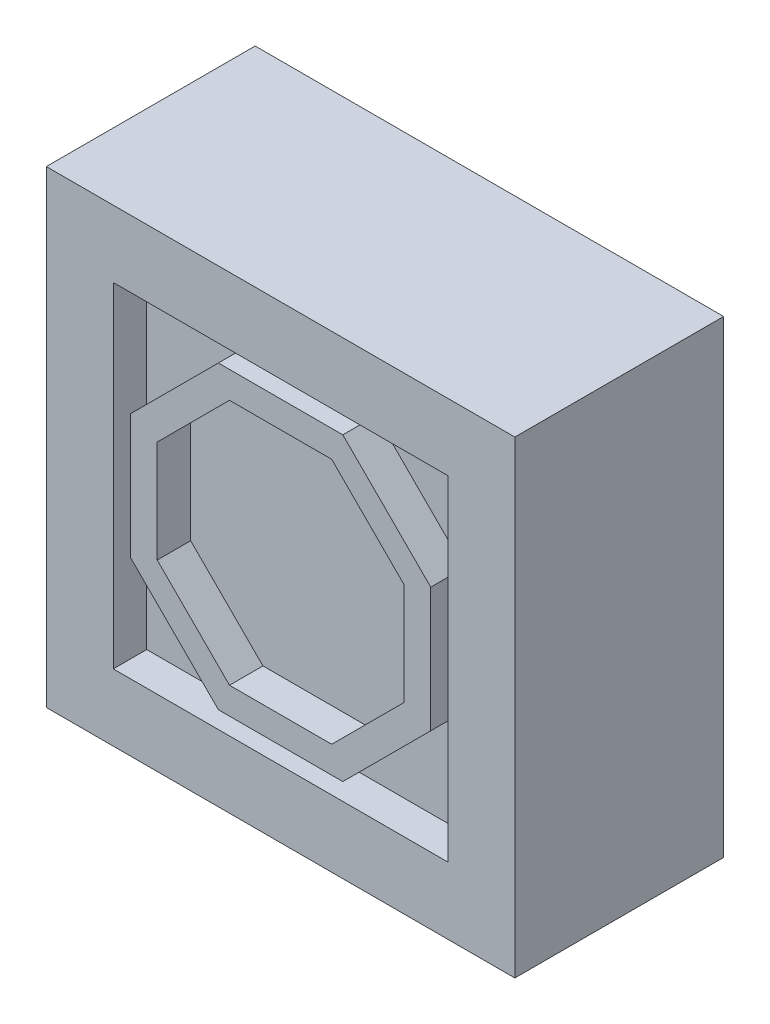
ISO-10303-21;
HEADER;
FILE_DESCRIPTION(('STEP AP214'),'2;1');
FILE_NAME('part.step','',(''),(''),'','','');
FILE_SCHEMA(('AUTOMOTIVE_DESIGN { 1 0 10303 214 1 1 1 1 }'));
ENDSEC;
DATA;
#1=APPLICATION_CONTEXT('core data for automotive mechanical design processes');
#2=APPLICATION_PROTOCOL_DEFINITION('international standard','automotive_design',2000,#1);
#3=PRODUCT_CONTEXT('',#1,'mechanical');
#4=PRODUCT('Part','Part','',(#3));
#5=PRODUCT_RELATED_PRODUCT_CATEGORY('part','',(#4));
#6=PRODUCT_DEFINITION_FORMATION('','',#4);
#7=PRODUCT_DEFINITION_CONTEXT('part definition',#1,'design');
#8=PRODUCT_DEFINITION('design','',#6,#7);
#9=PRODUCT_DEFINITION_SHAPE('','',#8);
#10=(LENGTH_UNIT() NAMED_UNIT(*) SI_UNIT(.MILLI.,.METRE.));
#11=(NAMED_UNIT(*) PLANE_ANGLE_UNIT() SI_UNIT($,.RADIAN.));
#12=(NAMED_UNIT(*) SI_UNIT($,.STERADIAN.) SOLID_ANGLE_UNIT());
#13=UNCERTAINTY_MEASURE_WITH_UNIT(LENGTH_MEASURE(1.E-05),#10,'distance_accuracy_value','');
#14=(GEOMETRIC_REPRESENTATION_CONTEXT(3) GLOBAL_UNCERTAINTY_ASSIGNED_CONTEXT((#13)) GLOBAL_UNIT_ASSIGNED_CONTEXT((#10,
#11,#12)) REPRESENTATION_CONTEXT('',''));
#15=CARTESIAN_POINT('',(0.,0.,0.));
#16=DIRECTION('',(0.,0.,1.));
#17=DIRECTION('',(1.,0.,0.));
#18=AXIS2_PLACEMENT_3D('',#15,#16,#17);
#19=CARTESIAN_POINT('',(-1.75,1.75,1.56));
#20=DIRECTION('',(1.,0.,0.));
#21=DIRECTION('',(0.,1.,0.));
#22=AXIS2_PLACEMENT_3D('',#19,#20,#21);
#23=PLANE('',#22);
#24=DIRECTION('',(0.,-1.,0.));
#25=VECTOR('',#24,1.);
#26=CARTESIAN_POINT('',(-1.75,1.75,0.));
#27=LINE('',#26,#25);
#28=CARTESIAN_POINT('',(-1.75,1.75,0.));
#29=VERTEX_POINT('',#28);
#30=CARTESIAN_POINT('',(-1.75,-1.75,0.));
#31=VERTEX_POINT('',#30);
#32=EDGE_CURVE('E321',#29,#31,#27,.T.);
#33=ORIENTED_EDGE('',*,*,#32,.T.);
#34=DIRECTION('',(0.,0.,-1.));
#35=VECTOR('',#34,1.);
#36=CARTESIAN_POINT('',(-1.75,-1.75,1.56));
#37=LINE('',#36,#35);
#38=CARTESIAN_POINT('',(-1.75,-1.75,1.56));
#39=VERTEX_POINT('',#38);
#40=EDGE_CURVE('E11',#39,#31,#37,.T.);
#41=ORIENTED_EDGE('',*,*,#40,.F.);
#42=DIRECTION('',(0.,-1.,0.));
#43=VECTOR('',#42,1.);
#44=CARTESIAN_POINT('',(-1.75,1.75,1.56));
#45=LINE('',#44,#43);
#46=CARTESIAN_POINT('',(-1.75,1.75,1.56));
#47=VERTEX_POINT('',#46);
#48=EDGE_CURVE('E328',#47,#39,#45,.T.);
#49=ORIENTED_EDGE('',*,*,#48,.F.);
#50=DIRECTION('',(0.,0.,-1.));
#51=VECTOR('',#50,1.);
#52=CARTESIAN_POINT('',(-1.75,1.75,1.56));
#53=LINE('',#52,#51);
#54=EDGE_CURVE('E338',#47,#29,#53,.T.);
#55=ORIENTED_EDGE('',*,*,#54,.T.);
#56=EDGE_LOOP('',(#33,#41,#49,#55));
#57=FACE_BOUND('',#56,.T.);
#58=ADVANCED_FACE('F39',(#57),#23,.F.);
#59=CARTESIAN_POINT('',(1.75,-1.75,1.56));
#60=DIRECTION('',(0.,1.,0.));
#61=DIRECTION('',(-1.,0.,0.));
#62=AXIS2_PLACEMENT_3D('',#59,#60,#61);
#63=PLANE('',#62);
#64=DIRECTION('',(1.,0.,0.));
#65=VECTOR('',#64,1.);
#66=CARTESIAN_POINT('',(1.75,-1.75,0.));
#67=LINE('',#66,#65);
#68=CARTESIAN_POINT('',(1.75,-1.75,0.));
#69=VERTEX_POINT('',#68);
#70=EDGE_CURVE('E341',#31,#69,#67,.T.);
#71=ORIENTED_EDGE('',*,*,#70,.T.);
#72=DIRECTION('',(0.,0.,-1.));
#73=VECTOR('',#72,1.);
#74=CARTESIAN_POINT('',(1.75,-1.75,1.56));
#75=LINE('',#74,#73);
#76=CARTESIAN_POINT('',(1.75,-1.75,1.56));
#77=VERTEX_POINT('',#76);
#78=EDGE_CURVE('E46',#77,#69,#75,.T.);
#79=ORIENTED_EDGE('',*,*,#78,.F.);
#80=DIRECTION('',(1.,0.,0.));
#81=VECTOR('',#80,1.);
#82=CARTESIAN_POINT('',(1.75,-1.75,1.56));
#83=LINE('',#82,#81);
#84=EDGE_CURVE('E331',#39,#77,#83,.T.);
#85=ORIENTED_EDGE('',*,*,#84,.F.);
#86=ORIENTED_EDGE('',*,*,#40,.T.);
#87=EDGE_LOOP('',(#71,#79,#85,#86));
#88=FACE_BOUND('',#87,.T.);
#89=ADVANCED_FACE('F371',(#88),#63,.F.);
#90=CARTESIAN_POINT('',(1.75,1.75,1.56));
#91=DIRECTION('',(-1.,0.,0.));
#92=DIRECTION('',(0.,-1.,0.));
#93=AXIS2_PLACEMENT_3D('',#90,#91,#92);
#94=PLANE('',#93);
#95=DIRECTION('',(0.,1.,0.));
#96=VECTOR('',#95,1.);
#97=CARTESIAN_POINT('',(1.75,1.75,0.));
#98=LINE('',#97,#96);
#99=CARTESIAN_POINT('',(1.75,1.75,0.));
#100=VERTEX_POINT('',#99);
#101=EDGE_CURVE('E343',#69,#100,#98,.T.);
#102=ORIENTED_EDGE('',*,*,#101,.T.);
#103=DIRECTION('',(0.,0.,-1.));
#104=VECTOR('',#103,1.);
#105=CARTESIAN_POINT('',(1.75,1.75,1.56));
#106=LINE('',#105,#104);
#107=CARTESIAN_POINT('',(1.75,1.75,1.56));
#108=VERTEX_POINT('',#107);
#109=EDGE_CURVE('E348',#108,#100,#106,.T.);
#110=ORIENTED_EDGE('',*,*,#109,.F.);
#111=DIRECTION('',(0.,1.,0.));
#112=VECTOR('',#111,1.);
#113=CARTESIAN_POINT('',(1.75,1.75,1.56));
#114=LINE('',#113,#112);
#115=EDGE_CURVE('E334',#77,#108,#114,.T.);
#116=ORIENTED_EDGE('',*,*,#115,.F.);
#117=ORIENTED_EDGE('',*,*,#78,.T.);
#118=EDGE_LOOP('',(#102,#110,#116,#117));
#119=FACE_BOUND('',#118,.T.);
#120=ADVANCED_FACE('F355',(#119),#94,.F.);
#121=CARTESIAN_POINT('',(1.75,1.75,1.56));
#122=DIRECTION('',(0.,-1.,0.));
#123=DIRECTION('',(1.,0.,0.));
#124=AXIS2_PLACEMENT_3D('',#121,#122,#123);
#125=PLANE('',#124);
#126=DIRECTION('',(-1.,0.,0.));
#127=VECTOR('',#126,1.);
#128=CARTESIAN_POINT('',(1.75,1.75,0.));
#129=LINE('',#128,#127);
#130=EDGE_CURVE('E332',#100,#29,#129,.T.);
#131=ORIENTED_EDGE('',*,*,#130,.T.);
#132=ORIENTED_EDGE('',*,*,#54,.F.);
#133=DIRECTION('',(-1.,0.,0.));
#134=VECTOR('',#133,1.);
#135=CARTESIAN_POINT('',(1.75,1.75,1.56));
#136=LINE('',#135,#134);
#137=EDGE_CURVE('E336',#108,#47,#136,.T.);
#138=ORIENTED_EDGE('',*,*,#137,.F.);
#139=ORIENTED_EDGE('',*,*,#109,.T.);
#140=EDGE_LOOP('',(#131,#132,#138,#139));
#141=FACE_BOUND('',#140,.T.);
#142=ADVANCED_FACE('F364',(#141),#125,.F.);
#143=CARTESIAN_POINT('',(0.,0.,1.56));
#144=DIRECTION('',(0.,0.,-1.));
#145=DIRECTION('',(-1.,0.,0.));
#146=AXIS2_PLACEMENT_3D('',#143,#144,#145);
#147=PLANE('',#146);
#148=DIRECTION('',(0.,-1.,0.));
#149=VECTOR('',#148,1.);
#150=CARTESIAN_POINT('',(-1.25,1.25,1.56));
#151=LINE('',#150,#149);
#152=CARTESIAN_POINT('',(-1.25,1.25,1.56));
#153=VERTEX_POINT('',#152);
#154=CARTESIAN_POINT('',(-1.25,-1.25,1.56));
#155=VERTEX_POINT('',#154);
#156=EDGE_CURVE('E310',#153,#155,#151,.T.);
#157=ORIENTED_EDGE('',*,*,#156,.F.);
#158=DIRECTION('',(-1.,0.,0.));
#159=VECTOR('',#158,1.);
#160=CARTESIAN_POINT('',(1.25,1.25,1.56));
#161=LINE('',#160,#159);
#162=CARTESIAN_POINT('',(1.25,1.25,1.56));
#163=VERTEX_POINT('',#162);
#164=EDGE_CURVE('E308',#163,#153,#161,.T.);
#165=ORIENTED_EDGE('',*,*,#164,.F.);
#166=DIRECTION('',(0.,1.,0.));
#167=VECTOR('',#166,1.);
#168=CARTESIAN_POINT('',(1.25,-1.25,1.56));
#169=LINE('',#168,#167);
#170=CARTESIAN_POINT('',(1.25,-1.25,1.56));
#171=VERTEX_POINT('',#170);
#172=EDGE_CURVE('E298',#171,#163,#169,.T.);
#173=ORIENTED_EDGE('',*,*,#172,.F.);
#174=DIRECTION('',(1.,0.,0.));
#175=VECTOR('',#174,1.);
#176=CARTESIAN_POINT('',(-1.25,-1.25,1.56));
#177=LINE('',#176,#175);
#178=EDGE_CURVE('E314',#155,#171,#177,.T.);
#179=ORIENTED_EDGE('',*,*,#178,.F.);
#180=EDGE_LOOP('',(#157,#165,#173,#179));
#181=FACE_BOUND('',#180,.T.);
#182=ORIENTED_EDGE('',*,*,#48,.T.);
#183=ORIENTED_EDGE('',*,*,#84,.T.);
#184=ORIENTED_EDGE('',*,*,#115,.T.);
#185=ORIENTED_EDGE('',*,*,#137,.T.);
#186=EDGE_LOOP('',(#182,#183,#184,#185));
#187=FACE_BOUND('',#186,.T.);
#188=ADVANCED_FACE('F370',(#181,#187),#147,.F.);
#189=CARTESIAN_POINT('',(0.,0.,0.));
#190=DIRECTION('',(0.,0.,-1.));
#191=DIRECTION('',(-1.,0.,0.));
#192=AXIS2_PLACEMENT_3D('',#189,#190,#191);
#193=PLANE('',#192);
#194=ORIENTED_EDGE('',*,*,#32,.F.);
#195=ORIENTED_EDGE('',*,*,#130,.F.);
#196=ORIENTED_EDGE('',*,*,#101,.F.);
#197=ORIENTED_EDGE('',*,*,#70,.F.);
#198=EDGE_LOOP('',(#194,#195,#196,#197));
#199=FACE_BOUND('',#198,.T.);
#200=ADVANCED_FACE('F361',(#199),#193,.T.);
#201=CARTESIAN_POINT('',(1.25,1.25,1.31));
#202=DIRECTION('',(0.,1.,0.));
#203=DIRECTION('',(-1.,0.,0.));
#204=AXIS2_PLACEMENT_3D('',#201,#202,#203);
#205=PLANE('',#204);
#206=ORIENTED_EDGE('',*,*,#164,.T.);
#207=DIRECTION('',(0.,0.,1.));
#208=VECTOR('',#207,1.);
#209=CARTESIAN_POINT('',(-1.25,1.25,1.31));
#210=LINE('',#209,#208);
#211=CARTESIAN_POINT('',(-1.25,1.25,1.31));
#212=VERTEX_POINT('',#211);
#213=EDGE_CURVE('E307',#212,#153,#210,.T.);
#214=ORIENTED_EDGE('',*,*,#213,.F.);
#215=DIRECTION('',(-1.,0.,0.));
#216=VECTOR('',#215,1.);
#217=CARTESIAN_POINT('',(1.25,1.25,1.31));
#218=LINE('',#217,#216);
#219=CARTESIAN_POINT('',(1.25,1.25,1.31));
#220=VERTEX_POINT('',#219);
#221=EDGE_CURVE('E294',#220,#212,#218,.T.);
#222=ORIENTED_EDGE('',*,*,#221,.F.);
#223=DIRECTION('',(0.,0.,1.));
#224=VECTOR('',#223,1.);
#225=CARTESIAN_POINT('',(1.25,1.25,1.31));
#226=LINE('',#225,#224);
#227=EDGE_CURVE('E319',#220,#163,#226,.T.);
#228=ORIENTED_EDGE('',*,*,#227,.T.);
#229=EDGE_LOOP('',(#206,#214,#222,#228));
#230=FACE_BOUND('',#229,.T.);
#231=ADVANCED_FACE('F383',(#230),#205,.F.);
#232=CARTESIAN_POINT('',(1.25,-1.25,1.31));
#233=DIRECTION('',(1.,0.,0.));
#234=DIRECTION('',(0.,1.,0.));
#235=AXIS2_PLACEMENT_3D('',#232,#233,#234);
#236=PLANE('',#235);
#237=ORIENTED_EDGE('',*,*,#172,.T.);
#238=ORIENTED_EDGE('',*,*,#227,.F.);
#239=DIRECTION('',(0.,1.,0.));
#240=VECTOR('',#239,1.);
#241=CARTESIAN_POINT('',(1.25,-1.25,1.31));
#242=LINE('',#241,#240);
#243=CARTESIAN_POINT('',(1.25,-1.25,1.31));
#244=VERTEX_POINT('',#243);
#245=EDGE_CURVE('E304',#244,#220,#242,.T.);
#246=ORIENTED_EDGE('',*,*,#245,.F.);
#247=DIRECTION('',(0.,0.,1.));
#248=VECTOR('',#247,1.);
#249=CARTESIAN_POINT('',(1.25,-1.25,1.31));
#250=LINE('',#249,#248);
#251=EDGE_CURVE('E322',#244,#171,#250,.T.);
#252=ORIENTED_EDGE('',*,*,#251,.T.);
#253=EDGE_LOOP('',(#237,#238,#246,#252));
#254=FACE_BOUND('',#253,.T.);
#255=ADVANCED_FACE('F389',(#254),#236,.F.);
#256=CARTESIAN_POINT('',(-1.25,-1.25,1.31));
#257=DIRECTION('',(0.,-1.,0.));
#258=DIRECTION('',(1.,0.,0.));
#259=AXIS2_PLACEMENT_3D('',#256,#257,#258);
#260=PLANE('',#259);
#261=ORIENTED_EDGE('',*,*,#178,.T.);
#262=ORIENTED_EDGE('',*,*,#251,.F.);
#263=DIRECTION('',(1.,0.,0.));
#264=VECTOR('',#263,1.);
#265=CARTESIAN_POINT('',(-1.25,-1.25,1.31));
#266=LINE('',#265,#264);
#267=CARTESIAN_POINT('',(-1.25,-1.25,1.31));
#268=VERTEX_POINT('',#267);
#269=EDGE_CURVE('E301',#268,#244,#266,.T.);
#270=ORIENTED_EDGE('',*,*,#269,.F.);
#271=DIRECTION('',(0.,0.,1.));
#272=VECTOR('',#271,1.);
#273=CARTESIAN_POINT('',(-1.25,-1.25,1.31));
#274=LINE('',#273,#272);
#275=EDGE_CURVE('E324',#268,#155,#274,.T.);
#276=ORIENTED_EDGE('',*,*,#275,.T.);
#277=EDGE_LOOP('',(#261,#262,#270,#276));
#278=FACE_BOUND('',#277,.T.);
#279=ADVANCED_FACE('F395',(#278),#260,.F.);
#280=CARTESIAN_POINT('',(-1.25,1.25,1.31));
#281=DIRECTION('',(-1.,0.,0.));
#282=DIRECTION('',(0.,-1.,0.));
#283=AXIS2_PLACEMENT_3D('',#280,#281,#282);
#284=PLANE('',#283);
#285=ORIENTED_EDGE('',*,*,#156,.T.);
#286=ORIENTED_EDGE('',*,*,#275,.F.);
#287=DIRECTION('',(0.,-1.,0.));
#288=VECTOR('',#287,1.);
#289=CARTESIAN_POINT('',(-1.25,1.25,1.31));
#290=LINE('',#289,#288);
#291=EDGE_CURVE('E297',#212,#268,#290,.T.);
#292=ORIENTED_EDGE('',*,*,#291,.F.);
#293=ORIENTED_EDGE('',*,*,#213,.T.);
#294=EDGE_LOOP('',(#285,#286,#292,#293));
#295=FACE_BOUND('',#294,.T.);
#296=ADVANCED_FACE('F391',(#295),#284,.F.);
#297=CARTESIAN_POINT('',(0.,0.,1.31));
#298=DIRECTION('',(0.,0.,1.));
#299=DIRECTION('',(1.,0.,0.));
#300=AXIS2_PLACEMENT_3D('',#297,#298,#299);
#301=PLANE('',#300);
#302=DIRECTION('',(0.707106781186548,0.707106781186548,0.));
#303=VECTOR('',#302,1.);
#304=CARTESIAN_POINT('',(-0.464655200100848,1.12177688591065,1.31));
#305=LINE('',#304,#303);
#306=CARTESIAN_POINT('',(-1.12177688591065,0.464655200100848,1.31));
#307=VERTEX_POINT('',#306);
#308=CARTESIAN_POINT('',(-0.464655200100848,1.12177688591065,1.31));
#309=VERTEX_POINT('',#308);
#310=EDGE_CURVE('E311',#307,#309,#305,.T.);
#311=ORIENTED_EDGE('',*,*,#310,.T.);
#312=DIRECTION('',(1.,0.,0.));
#313=VECTOR('',#312,1.);
#314=CARTESIAN_POINT('',(0.464655200100848,1.12177688591065,1.31));
#315=LINE('',#314,#313);
#316=CARTESIAN_POINT('',(0.464655200100848,1.12177688591065,1.31));
#317=VERTEX_POINT('',#316);
#318=EDGE_CURVE('E478',#309,#317,#315,.T.);
#319=ORIENTED_EDGE('',*,*,#318,.T.);
#320=DIRECTION('',(0.707106781186548,-0.707106781186548,0.));
#321=VECTOR('',#320,1.);
#322=CARTESIAN_POINT('',(1.12177688591065,0.464655200100849,1.31));
#323=LINE('',#322,#321);
#324=CARTESIAN_POINT('',(1.12177688591065,0.464655200100849,1.31));
#325=VERTEX_POINT('',#324);
#326=EDGE_CURVE('E497',#317,#325,#323,.T.);
#327=ORIENTED_EDGE('',*,*,#326,.T.);
#328=DIRECTION('',(0.,-1.,0.));
#329=VECTOR('',#328,1.);
#330=CARTESIAN_POINT('',(1.12177688591065,-0.464655200100849,1.31));
#331=LINE('',#330,#329);
#332=CARTESIAN_POINT('',(1.12177688591065,-0.464655200100849,1.31));
#333=VERTEX_POINT('',#332);
#334=EDGE_CURVE('E495',#325,#333,#331,.T.);
#335=ORIENTED_EDGE('',*,*,#334,.T.);
#336=DIRECTION('',(-0.707106781186547,-0.707106781186548,0.));
#337=VECTOR('',#336,1.);
#338=CARTESIAN_POINT('',(0.464655200100849,-1.12177688591065,1.31));
#339=LINE('',#338,#337);
#340=CARTESIAN_POINT('',(0.464655200100849,-1.12177688591065,1.31));
#341=VERTEX_POINT('',#340);
#342=EDGE_CURVE('E493',#333,#341,#339,.T.);
#343=ORIENTED_EDGE('',*,*,#342,.T.);
#344=DIRECTION('',(-1.,0.,0.));
#345=VECTOR('',#344,1.);
#346=CARTESIAN_POINT('',(-0.464655200100848,-1.12177688591065,1.31));
#347=LINE('',#346,#345);
#348=CARTESIAN_POINT('',(-0.464655200100848,-1.12177688591065,1.31));
#349=VERTEX_POINT('',#348);
#350=EDGE_CURVE('E491',#341,#349,#347,.T.);
#351=ORIENTED_EDGE('',*,*,#350,.T.);
#352=DIRECTION('',(-0.707106781186548,0.707106781186548,0.));
#353=VECTOR('',#352,1.);
#354=CARTESIAN_POINT('',(-1.12177688591065,-0.464655200100849,1.31));
#355=LINE('',#354,#353);
#356=CARTESIAN_POINT('',(-1.12177688591065,-0.464655200100849,1.31));
#357=VERTEX_POINT('',#356);
#358=EDGE_CURVE('E58',#349,#357,#355,.T.);
#359=ORIENTED_EDGE('',*,*,#358,.T.);
#360=DIRECTION('',(0.,1.,0.));
#361=VECTOR('',#360,1.);
#362=CARTESIAN_POINT('',(-1.12177688591065,0.464655200100848,1.31));
#363=LINE('',#362,#361);
#364=EDGE_CURVE('E53',#357,#307,#363,.T.);
#365=ORIENTED_EDGE('',*,*,#364,.T.);
#366=EDGE_LOOP('',(#311,#319,#327,#335,#343,#351,#359,#365));
#367=FACE_BOUND('',#366,.T.);
#368=ORIENTED_EDGE('',*,*,#221,.T.);
#369=ORIENTED_EDGE('',*,*,#291,.T.);
#370=ORIENTED_EDGE('',*,*,#269,.T.);
#371=ORIENTED_EDGE('',*,*,#245,.T.);
#372=EDGE_LOOP('',(#368,#369,#370,#371));
#373=FACE_BOUND('',#372,.T.);
#374=ADVANCED_FACE('F394',(#367,#373),#301,.T.);
#375=CARTESIAN_POINT('',(-0.464655200100848,1.12177688591065,-1.862864172023));
#376=DIRECTION('',(-0.707106781186548,0.707106781186548,0.));
#377=DIRECTION('',(-0.707106781186548,-0.707106781186548,0.));
#378=AXIS2_PLACEMENT_3D('',#375,#376,#377);
#379=PLANE('',#378);
#380=ORIENTED_EDGE('',*,*,#310,.F.);
#381=DIRECTION('',(0.,0.,1.));
#382=VECTOR('',#381,1.);
#383=CARTESIAN_POINT('',(-1.12177688591065,0.464655200100848,-1.862864172023));
#384=LINE('',#383,#382);
#385=CARTESIAN_POINT('',(-1.12177688591065,0.464655200100848,1.56));
#386=VERTEX_POINT('',#385);
#387=EDGE_CURVE('E290',#307,#386,#384,.T.);
#388=ORIENTED_EDGE('',*,*,#387,.T.);
#389=DIRECTION('',(-0.707106781186547,-0.707106781186548,0.));
#390=VECTOR('',#389,1.);
#391=CARTESIAN_POINT('',(-0.464655200100848,1.12177688591065,1.56));
#392=LINE('',#391,#390);
#393=CARTESIAN_POINT('',(-0.464655200100848,1.12177688591065,1.56));
#394=VERTEX_POINT('',#393);
#395=EDGE_CURVE('E255',#394,#386,#392,.T.);
#396=ORIENTED_EDGE('',*,*,#395,.F.);
#397=DIRECTION('',(0.,0.,1.));
#398=VECTOR('',#397,1.);
#399=CARTESIAN_POINT('',(-0.464655200100848,1.12177688591065,-1.862864172023));
#400=LINE('',#399,#398);
#401=EDGE_CURVE('E276',#309,#394,#400,.T.);
#402=ORIENTED_EDGE('',*,*,#401,.F.);
#403=EDGE_LOOP('',(#380,#388,#396,#402));
#404=FACE_BOUND('',#403,.T.);
#405=ADVANCED_FACE('F405',(#404),#379,.T.);
#406=CARTESIAN_POINT('',(-1.12177688591065,0.464655200100848,-1.862864172023));
#407=DIRECTION('',(-1.,0.,0.));
#408=DIRECTION('',(0.,-1.,0.));
#409=AXIS2_PLACEMENT_3D('',#406,#407,#408);
#410=PLANE('',#409);
#411=ORIENTED_EDGE('',*,*,#364,.F.);
#412=DIRECTION('',(0.,0.,1.));
#413=VECTOR('',#412,1.);
#414=CARTESIAN_POINT('',(-1.12177688591065,-0.464655200100849,-1.862864172023));
#415=LINE('',#414,#413);
#416=CARTESIAN_POINT('',(-1.12177688591065,-0.464655200100849,1.56));
#417=VERTEX_POINT('',#416);
#418=EDGE_CURVE('E288',#357,#417,#415,.T.);
#419=ORIENTED_EDGE('',*,*,#418,.T.);
#420=DIRECTION('',(0.,-1.,0.));
#421=VECTOR('',#420,1.);
#422=CARTESIAN_POINT('',(-1.12177688591065,0.464655200100848,1.56));
#423=LINE('',#422,#421);
#424=EDGE_CURVE('E258',#386,#417,#423,.T.);
#425=ORIENTED_EDGE('',*,*,#424,.F.);
#426=ORIENTED_EDGE('',*,*,#387,.F.);
#427=EDGE_LOOP('',(#411,#419,#425,#426));
#428=FACE_BOUND('',#427,.T.);
#429=ADVANCED_FACE('F414',(#428),#410,.T.);
#430=CARTESIAN_POINT('',(-1.12177688591065,-0.464655200100849,-1.862864172023));
#431=DIRECTION('',(-0.707106781186548,-0.707106781186548,0.));
#432=DIRECTION('',(0.707106781186548,-0.707106781186548,0.));
#433=AXIS2_PLACEMENT_3D('',#430,#431,#432);
#434=PLANE('',#433);
#435=ORIENTED_EDGE('',*,*,#358,.F.);
#436=DIRECTION('',(0.,0.,1.));
#437=VECTOR('',#436,1.);
#438=CARTESIAN_POINT('',(-0.464655200100848,-1.12177688591065,-1.862864172023));
#439=LINE('',#438,#437);
#440=CARTESIAN_POINT('',(-0.464655200100848,-1.12177688591065,1.56));
#441=VERTEX_POINT('',#440);
#442=EDGE_CURVE('E286',#349,#441,#439,.T.);
#443=ORIENTED_EDGE('',*,*,#442,.T.);
#444=DIRECTION('',(0.707106781186548,-0.707106781186548,0.));
#445=VECTOR('',#444,1.);
#446=CARTESIAN_POINT('',(-1.12177688591065,-0.464655200100849,1.56));
#447=LINE('',#446,#445);
#448=EDGE_CURVE('E261',#417,#441,#447,.T.);
#449=ORIENTED_EDGE('',*,*,#448,.F.);
#450=ORIENTED_EDGE('',*,*,#418,.F.);
#451=EDGE_LOOP('',(#435,#443,#449,#450));
#452=FACE_BOUND('',#451,.T.);
#453=ADVANCED_FACE('F418',(#452),#434,.T.);
#454=CARTESIAN_POINT('',(-0.464655200100848,-1.12177688591065,-1.862864172023));
#455=DIRECTION('',(0.,-1.,0.));
#456=DIRECTION('',(1.,0.,0.));
#457=AXIS2_PLACEMENT_3D('',#454,#455,#456);
#458=PLANE('',#457);
#459=ORIENTED_EDGE('',*,*,#350,.F.);
#460=DIRECTION('',(0.,0.,1.));
#461=VECTOR('',#460,1.);
#462=CARTESIAN_POINT('',(0.464655200100849,-1.12177688591065,-1.862864172023));
#463=LINE('',#462,#461);
#464=CARTESIAN_POINT('',(0.464655200100849,-1.12177688591065,1.56));
#465=VERTEX_POINT('',#464);
#466=EDGE_CURVE('E284',#341,#465,#463,.T.);
#467=ORIENTED_EDGE('',*,*,#466,.T.);
#468=DIRECTION('',(1.,0.,0.));
#469=VECTOR('',#468,1.);
#470=CARTESIAN_POINT('',(-0.464655200100848,-1.12177688591065,1.56));
#471=LINE('',#470,#469);
#472=EDGE_CURVE('E264',#441,#465,#471,.T.);
#473=ORIENTED_EDGE('',*,*,#472,.F.);
#474=ORIENTED_EDGE('',*,*,#442,.F.);
#475=EDGE_LOOP('',(#459,#467,#473,#474));
#476=FACE_BOUND('',#475,.T.);
#477=ADVANCED_FACE('F422',(#476),#458,.T.);
#478=CARTESIAN_POINT('',(0.464655200100849,-1.12177688591065,-1.862864172023));
#479=DIRECTION('',(0.707106781186548,-0.707106781186547,0.));
#480=DIRECTION('',(0.707106781186547,0.707106781186548,0.));
#481=AXIS2_PLACEMENT_3D('',#478,#479,#480);
#482=PLANE('',#481);
#483=ORIENTED_EDGE('',*,*,#342,.F.);
#484=DIRECTION('',(0.,0.,1.));
#485=VECTOR('',#484,1.);
#486=CARTESIAN_POINT('',(1.12177688591065,-0.464655200100849,-1.862864172023));
#487=LINE('',#486,#485);
#488=CARTESIAN_POINT('',(1.12177688591065,-0.464655200100849,1.56));
#489=VERTEX_POINT('',#488);
#490=EDGE_CURVE('E282',#333,#489,#487,.T.);
#491=ORIENTED_EDGE('',*,*,#490,.T.);
#492=DIRECTION('',(0.707106781186547,0.707106781186548,0.));
#493=VECTOR('',#492,1.);
#494=CARTESIAN_POINT('',(0.464655200100849,-1.12177688591065,1.56));
#495=LINE('',#494,#493);
#496=EDGE_CURVE('E267',#465,#489,#495,.T.);
#497=ORIENTED_EDGE('',*,*,#496,.F.);
#498=ORIENTED_EDGE('',*,*,#466,.F.);
#499=EDGE_LOOP('',(#483,#491,#497,#498));
#500=FACE_BOUND('',#499,.T.);
#501=ADVANCED_FACE('F426',(#500),#482,.T.);
#502=CARTESIAN_POINT('',(1.12177688591065,-0.464655200100849,-1.862864172023));
#503=DIRECTION('',(1.,0.,0.));
#504=DIRECTION('',(0.,0.,-1.));
#505=AXIS2_PLACEMENT_3D('',#502,#503,#504);
#506=PLANE('',#505);
#507=ORIENTED_EDGE('',*,*,#334,.F.);
#508=DIRECTION('',(0.,0.,1.));
#509=VECTOR('',#508,1.);
#510=CARTESIAN_POINT('',(1.12177688591065,0.464655200100849,-1.862864172023));
#511=LINE('',#510,#509);
#512=CARTESIAN_POINT('',(1.12177688591065,0.464655200100849,1.56));
#513=VERTEX_POINT('',#512);
#514=EDGE_CURVE('E280',#325,#513,#511,.T.);
#515=ORIENTED_EDGE('',*,*,#514,.T.);
#516=DIRECTION('',(0.,1.,0.));
#517=VECTOR('',#516,1.);
#518=CARTESIAN_POINT('',(1.12177688591065,-0.464655200100849,1.56));
#519=LINE('',#518,#517);
#520=EDGE_CURVE('E270',#489,#513,#519,.T.);
#521=ORIENTED_EDGE('',*,*,#520,.F.);
#522=ORIENTED_EDGE('',*,*,#490,.F.);
#523=EDGE_LOOP('',(#507,#515,#521,#522));
#524=FACE_BOUND('',#523,.T.);
#525=ADVANCED_FACE('F430',(#524),#506,.T.);
#526=CARTESIAN_POINT('',(1.12177688591065,0.464655200100849,-1.862864172023));
#527=DIRECTION('',(0.707106781186548,0.707106781186548,0.));
#528=DIRECTION('',(-0.707106781186548,0.707106781186548,0.));
#529=AXIS2_PLACEMENT_3D('',#526,#527,#528);
#530=PLANE('',#529);
#531=ORIENTED_EDGE('',*,*,#326,.F.);
#532=DIRECTION('',(0.,0.,1.));
#533=VECTOR('',#532,1.);
#534=CARTESIAN_POINT('',(0.464655200100848,1.12177688591065,-1.862864172023));
#535=LINE('',#534,#533);
#536=CARTESIAN_POINT('',(0.464655200100848,1.12177688591065,1.56));
#537=VERTEX_POINT('',#536);
#538=EDGE_CURVE('E277',#317,#537,#535,.T.);
#539=ORIENTED_EDGE('',*,*,#538,.T.);
#540=DIRECTION('',(-0.707106781186548,0.707106781186547,0.));
#541=VECTOR('',#540,1.);
#542=CARTESIAN_POINT('',(1.12177688591065,0.464655200100849,1.56));
#543=LINE('',#542,#541);
#544=EDGE_CURVE('E273',#513,#537,#543,.T.);
#545=ORIENTED_EDGE('',*,*,#544,.F.);
#546=ORIENTED_EDGE('',*,*,#514,.F.);
#547=EDGE_LOOP('',(#531,#539,#545,#546));
#548=FACE_BOUND('',#547,.T.);
#549=ADVANCED_FACE('F410',(#548),#530,.T.);
#550=CARTESIAN_POINT('',(0.464655200100848,1.12177688591065,-1.862864172023));
#551=DIRECTION('',(0.,1.,0.));
#552=DIRECTION('',(0.,0.,1.));
#553=AXIS2_PLACEMENT_3D('',#550,#551,#552);
#554=PLANE('',#553);
#555=ORIENTED_EDGE('',*,*,#318,.F.);
#556=ORIENTED_EDGE('',*,*,#401,.T.);
#557=DIRECTION('',(-1.,0.,0.));
#558=VECTOR('',#557,1.);
#559=CARTESIAN_POINT('',(0.464655200100848,1.12177688591065,1.56));
#560=LINE('',#559,#558);
#561=EDGE_CURVE('E242',#537,#394,#560,.T.);
#562=ORIENTED_EDGE('',*,*,#561,.F.);
#563=ORIENTED_EDGE('',*,*,#538,.F.);
#564=EDGE_LOOP('',(#555,#556,#562,#563));
#565=FACE_BOUND('',#564,.T.);
#566=ADVANCED_FACE('F407',(#565),#554,.T.);
#567=CARTESIAN_POINT('',(0.,0.,1.56));
#568=DIRECTION('',(0.,0.,1.));
#569=DIRECTION('',(1.,0.,0.));
#570=AXIS2_PLACEMENT_3D('',#567,#568,#569);
#571=PLANE('',#570);
#572=DIRECTION('',(-1.,0.,0.));
#573=VECTOR('',#572,1.);
#574=CARTESIAN_POINT('',(0.38181248762623,0.921776885910652,1.56));
#575=LINE('',#574,#573);
#576=CARTESIAN_POINT('',(0.38181248762623,0.921776885910652,1.56));
#577=VERTEX_POINT('',#576);
#578=CARTESIAN_POINT('',(-0.381812487626229,0.921776885910652,1.56));
#579=VERTEX_POINT('',#578);
#580=EDGE_CURVE('E217',#577,#579,#575,.T.);
#581=ORIENTED_EDGE('',*,*,#580,.F.);
#582=DIRECTION('',(-0.707106781186548,0.707106781186548,0.));
#583=VECTOR('',#582,1.);
#584=CARTESIAN_POINT('',(0.921776885910652,0.38181248762623,1.56));
#585=LINE('',#584,#583);
#586=CARTESIAN_POINT('',(0.921776885910652,0.38181248762623,1.56));
#587=VERTEX_POINT('',#586);
#588=EDGE_CURVE('E237',#587,#577,#585,.T.);
#589=ORIENTED_EDGE('',*,*,#588,.F.);
#590=DIRECTION('',(0.,1.,0.));
#591=VECTOR('',#590,1.);
#592=CARTESIAN_POINT('',(0.921776885910652,-0.38181248762623,1.56));
#593=LINE('',#592,#591);
#594=CARTESIAN_POINT('',(0.921776885910652,-0.38181248762623,1.56));
#595=VERTEX_POINT('',#594);
#596=EDGE_CURVE('E234',#595,#587,#593,.T.);
#597=ORIENTED_EDGE('',*,*,#596,.F.);
#598=DIRECTION('',(0.707106781186548,0.707106781186547,0.));
#599=VECTOR('',#598,1.);
#600=CARTESIAN_POINT('',(0.381812487626229,-0.921776885910653,1.56));
#601=LINE('',#600,#599);
#602=CARTESIAN_POINT('',(0.381812487626229,-0.921776885910653,1.56));
#603=VERTEX_POINT('',#602);
#604=EDGE_CURVE('E231',#603,#595,#601,.T.);
#605=ORIENTED_EDGE('',*,*,#604,.F.);
#606=DIRECTION('',(1.,0.,0.));
#607=VECTOR('',#606,1.);
#608=CARTESIAN_POINT('',(-0.381812487626229,-0.921776885910653,1.56));
#609=LINE('',#608,#607);
#610=CARTESIAN_POINT('',(-0.381812487626229,-0.921776885910653,1.56));
#611=VERTEX_POINT('',#610);
#612=EDGE_CURVE('E225',#611,#603,#609,.T.);
#613=ORIENTED_EDGE('',*,*,#612,.F.);
#614=DIRECTION('',(0.707106781186548,-0.707106781186548,0.));
#615=VECTOR('',#614,1.);
#616=CARTESIAN_POINT('',(-0.921776885910653,-0.381812487626229,1.56));
#617=LINE('',#616,#615);
#618=CARTESIAN_POINT('',(-0.921776885910653,-0.381812487626229,1.56));
#619=VERTEX_POINT('',#618);
#620=EDGE_CURVE('E223',#619,#611,#617,.T.);
#621=ORIENTED_EDGE('',*,*,#620,.F.);
#622=DIRECTION('',(0.,-1.,0.));
#623=VECTOR('',#622,1.);
#624=CARTESIAN_POINT('',(-0.921776885910653,0.381812487626229,1.56));
#625=LINE('',#624,#623);
#626=CARTESIAN_POINT('',(-0.921776885910653,0.381812487626229,1.56));
#627=VERTEX_POINT('',#626);
#628=EDGE_CURVE('E201',#627,#619,#625,.T.);
#629=ORIENTED_EDGE('',*,*,#628,.F.);
#630=DIRECTION('',(-0.707106781186547,-0.707106781186548,0.));
#631=VECTOR('',#630,1.);
#632=CARTESIAN_POINT('',(-0.381812487626229,0.921776885910652,1.56));
#633=LINE('',#632,#631);
#634=EDGE_CURVE('E211',#579,#627,#633,.T.);
#635=ORIENTED_EDGE('',*,*,#634,.F.);
#636=EDGE_LOOP('',(#581,#589,#597,#605,#613,#621,#629,#635));
#637=FACE_BOUND('',#636,.T.);
#638=ORIENTED_EDGE('',*,*,#561,.T.);
#639=ORIENTED_EDGE('',*,*,#395,.T.);
#640=ORIENTED_EDGE('',*,*,#424,.T.);
#641=ORIENTED_EDGE('',*,*,#448,.T.);
#642=ORIENTED_EDGE('',*,*,#472,.T.);
#643=ORIENTED_EDGE('',*,*,#496,.T.);
#644=ORIENTED_EDGE('',*,*,#520,.T.);
#645=ORIENTED_EDGE('',*,*,#544,.T.);
#646=EDGE_LOOP('',(#638,#639,#640,#641,#642,#643,#644,#645));
#647=FACE_BOUND('',#646,.T.);
#648=ADVANCED_FACE('F219',(#637,#647),#571,.T.);
#649=CARTESIAN_POINT('',(-0.381812487626229,0.921776885910652,-1.862864172023));
#650=DIRECTION('',(-0.707106781186548,0.707106781186548,0.));
#651=DIRECTION('',(-0.707106781186548,-0.707106781186548,0.));
#652=AXIS2_PLACEMENT_3D('',#649,#650,#651);
#653=PLANE('',#652);
#654=DIRECTION('',(0.,0.,1.));
#655=VECTOR('',#654,1.);
#656=CARTESIAN_POINT('',(-0.921776885910653,0.381812487626229,-1.862864172023));
#657=LINE('',#656,#655);
#658=CARTESIAN_POINT('',(-0.921776885910653,0.381812487626229,1.31));
#659=VERTEX_POINT('',#658);
#660=EDGE_CURVE('E197',#659,#627,#657,.T.);
#661=ORIENTED_EDGE('',*,*,#660,.F.);
#662=DIRECTION('',(0.707106781186548,0.707106781186548,0.));
#663=VECTOR('',#662,1.);
#664=CARTESIAN_POINT('',(-0.381812487626229,0.921776885910652,1.31));
#665=LINE('',#664,#663);
#666=CARTESIAN_POINT('',(-0.381812487626229,0.921776885910652,1.31));
#667=VERTEX_POINT('',#666);
#668=EDGE_CURVE('E279',#659,#667,#665,.T.);
#669=ORIENTED_EDGE('',*,*,#668,.T.);
#670=DIRECTION('',(0.,0.,1.));
#671=VECTOR('',#670,1.);
#672=CARTESIAN_POINT('',(-0.381812487626229,0.921776885910652,-1.862864172023));
#673=LINE('',#672,#671);
#674=EDGE_CURVE('E208',#667,#579,#673,.T.);
#675=ORIENTED_EDGE('',*,*,#674,.T.);
#676=ORIENTED_EDGE('',*,*,#634,.T.);
#677=EDGE_LOOP('',(#661,#669,#675,#676));
#678=FACE_BOUND('',#677,.T.);
#679=ADVANCED_FACE('F212',(#678),#653,.F.);
#680=CARTESIAN_POINT('',(-0.921776885910653,0.381812487626229,-1.862864172023));
#681=DIRECTION('',(-1.,0.,0.));
#682=DIRECTION('',(0.,0.,1.));
#683=AXIS2_PLACEMENT_3D('',#680,#681,#682);
#684=PLANE('',#683);
#685=DIRECTION('',(0.,0.,1.));
#686=VECTOR('',#685,1.);
#687=CARTESIAN_POINT('',(-0.921776885910653,-0.381812487626229,-1.862864172023));
#688=LINE('',#687,#686);
#689=CARTESIAN_POINT('',(-0.921776885910653,-0.381812487626229,1.31));
#690=VERTEX_POINT('',#689);
#691=EDGE_CURVE('E207',#690,#619,#688,.T.);
#692=ORIENTED_EDGE('',*,*,#691,.F.);
#693=DIRECTION('',(0.,1.,0.));
#694=VECTOR('',#693,1.);
#695=CARTESIAN_POINT('',(-0.921776885910653,0.381812487626229,1.31));
#696=LINE('',#695,#694);
#697=EDGE_CURVE('E204',#690,#659,#696,.T.);
#698=ORIENTED_EDGE('',*,*,#697,.T.);
#699=ORIENTED_EDGE('',*,*,#660,.T.);
#700=ORIENTED_EDGE('',*,*,#628,.T.);
#701=EDGE_LOOP('',(#692,#698,#699,#700));
#702=FACE_BOUND('',#701,.T.);
#703=ADVANCED_FACE('F199',(#702),#684,.F.);
#704=CARTESIAN_POINT('',(-0.921776885910653,-0.381812487626229,-1.862864172023));
#705=DIRECTION('',(-0.707106781186548,-0.707106781186548,0.));
#706=DIRECTION('',(0.707106781186548,-0.707106781186548,0.));
#707=AXIS2_PLACEMENT_3D('',#704,#705,#706);
#708=PLANE('',#707);
#709=DIRECTION('',(0.,0.,1.));
#710=VECTOR('',#709,1.);
#711=CARTESIAN_POINT('',(-0.381812487626229,-0.921776885910653,-1.862864172023));
#712=LINE('',#711,#710);
#713=CARTESIAN_POINT('',(-0.38181248762623,-0.921776885910653,1.31));
#714=VERTEX_POINT('',#713);
#715=EDGE_CURVE('E249',#714,#611,#712,.T.);
#716=ORIENTED_EDGE('',*,*,#715,.F.);
#717=DIRECTION('',(-0.707106781186548,0.707106781186548,0.));
#718=VECTOR('',#717,1.);
#719=CARTESIAN_POINT('',(-0.921776885910653,-0.381812487626229,1.31));
#720=LINE('',#719,#718);
#721=EDGE_CURVE('E507',#714,#690,#720,.T.);
#722=ORIENTED_EDGE('',*,*,#721,.T.);
#723=ORIENTED_EDGE('',*,*,#691,.T.);
#724=ORIENTED_EDGE('',*,*,#620,.T.);
#725=EDGE_LOOP('',(#716,#722,#723,#724));
#726=FACE_BOUND('',#725,.T.);
#727=ADVANCED_FACE('F449',(#726),#708,.F.);
#728=CARTESIAN_POINT('',(-0.381812487626229,-0.921776885910653,-1.862864172023));
#729=DIRECTION('',(0.,-1.,0.));
#730=DIRECTION('',(0.,0.,-1.));
#731=AXIS2_PLACEMENT_3D('',#728,#729,#730);
#732=PLANE('',#731);
#733=DIRECTION('',(0.,0.,1.));
#734=VECTOR('',#733,1.);
#735=CARTESIAN_POINT('',(0.381812487626229,-0.921776885910653,-1.862864172023));
#736=LINE('',#735,#734);
#737=CARTESIAN_POINT('',(0.381812487626229,-0.921776885910653,1.31));
#738=VERTEX_POINT('',#737);
#739=EDGE_CURVE('E247',#738,#603,#736,.T.);
#740=ORIENTED_EDGE('',*,*,#739,.F.);
#741=DIRECTION('',(-1.,0.,0.));
#742=VECTOR('',#741,1.);
#743=CARTESIAN_POINT('',(-0.381812487626229,-0.921776885910653,1.31));
#744=LINE('',#743,#742);
#745=EDGE_CURVE('E504',#738,#714,#744,.T.);
#746=ORIENTED_EDGE('',*,*,#745,.T.);
#747=ORIENTED_EDGE('',*,*,#715,.T.);
#748=ORIENTED_EDGE('',*,*,#612,.T.);
#749=EDGE_LOOP('',(#740,#746,#747,#748));
#750=FACE_BOUND('',#749,.T.);
#751=ADVANCED_FACE('F452',(#750),#732,.F.);
#752=CARTESIAN_POINT('',(0.381812487626229,-0.921776885910653,-1.862864172023));
#753=DIRECTION('',(0.707106781186548,-0.707106781186548,0.));
#754=DIRECTION('',(0.707106781186548,0.707106781186547,0.));
#755=AXIS2_PLACEMENT_3D('',#752,#753,#754);
#756=PLANE('',#755);
#757=DIRECTION('',(0.,0.,1.));
#758=VECTOR('',#757,1.);
#759=CARTESIAN_POINT('',(0.921776885910652,-0.38181248762623,-1.862864172023));
#760=LINE('',#759,#758);
#761=CARTESIAN_POINT('',(0.921776885910652,-0.38181248762623,1.31));
#762=VERTEX_POINT('',#761);
#763=EDGE_CURVE('E245',#762,#595,#760,.T.);
#764=ORIENTED_EDGE('',*,*,#763,.F.);
#765=DIRECTION('',(-0.707106781186548,-0.707106781186547,0.));
#766=VECTOR('',#765,1.);
#767=CARTESIAN_POINT('',(0.381812487626229,-0.921776885910653,1.31));
#768=LINE('',#767,#766);
#769=EDGE_CURVE('E484',#762,#738,#768,.T.);
#770=ORIENTED_EDGE('',*,*,#769,.T.);
#771=ORIENTED_EDGE('',*,*,#739,.T.);
#772=ORIENTED_EDGE('',*,*,#604,.T.);
#773=EDGE_LOOP('',(#764,#770,#771,#772));
#774=FACE_BOUND('',#773,.T.);
#775=ADVANCED_FACE('F456',(#774),#756,.F.);
#776=CARTESIAN_POINT('',(0.921776885910652,-0.38181248762623,-1.862864172023));
#777=DIRECTION('',(1.,0.,0.));
#778=DIRECTION('',(0.,0.,-1.));
#779=AXIS2_PLACEMENT_3D('',#776,#777,#778);
#780=PLANE('',#779);
#781=DIRECTION('',(0.,0.,1.));
#782=VECTOR('',#781,1.);
#783=CARTESIAN_POINT('',(0.921776885910652,0.38181248762623,-1.862864172023));
#784=LINE('',#783,#782);
#785=CARTESIAN_POINT('',(0.921776885910652,0.38181248762623,1.31));
#786=VERTEX_POINT('',#785);
#787=EDGE_CURVE('E243',#786,#587,#784,.T.);
#788=ORIENTED_EDGE('',*,*,#787,.F.);
#789=DIRECTION('',(0.,-1.,0.));
#790=VECTOR('',#789,1.);
#791=CARTESIAN_POINT('',(0.921776885910652,-0.38181248762623,1.31));
#792=LINE('',#791,#790);
#793=EDGE_CURVE('E482',#786,#762,#792,.T.);
#794=ORIENTED_EDGE('',*,*,#793,.T.);
#795=ORIENTED_EDGE('',*,*,#763,.T.);
#796=ORIENTED_EDGE('',*,*,#596,.T.);
#797=EDGE_LOOP('',(#788,#794,#795,#796));
#798=FACE_BOUND('',#797,.T.);
#799=ADVANCED_FACE('F460',(#798),#780,.F.);
#800=CARTESIAN_POINT('',(0.921776885910652,0.38181248762623,-1.862864172023));
#801=DIRECTION('',(0.707106781186548,0.707106781186548,0.));
#802=DIRECTION('',(-0.707106781186548,0.707106781186548,0.));
#803=AXIS2_PLACEMENT_3D('',#800,#801,#802);
#804=PLANE('',#803);
#805=DIRECTION('',(0.,0.,1.));
#806=VECTOR('',#805,1.);
#807=CARTESIAN_POINT('',(0.38181248762623,0.921776885910652,-1.862864172023));
#808=LINE('',#807,#806);
#809=CARTESIAN_POINT('',(0.38181248762623,0.921776885910652,1.31));
#810=VERTEX_POINT('',#809);
#811=EDGE_CURVE('E240',#810,#577,#808,.T.);
#812=ORIENTED_EDGE('',*,*,#811,.F.);
#813=DIRECTION('',(0.707106781186548,-0.707106781186548,0.));
#814=VECTOR('',#813,1.);
#815=CARTESIAN_POINT('',(0.921776885910652,0.38181248762623,1.31));
#816=LINE('',#815,#814);
#817=EDGE_CURVE('E472',#810,#786,#816,.T.);
#818=ORIENTED_EDGE('',*,*,#817,.T.);
#819=ORIENTED_EDGE('',*,*,#787,.T.);
#820=ORIENTED_EDGE('',*,*,#588,.T.);
#821=EDGE_LOOP('',(#812,#818,#819,#820));
#822=FACE_BOUND('',#821,.T.);
#823=ADVANCED_FACE('F443',(#822),#804,.F.);
#824=CARTESIAN_POINT('',(0.38181248762623,0.921776885910652,-1.862864172023));
#825=DIRECTION('',(0.,1.,0.));
#826=DIRECTION('',(0.,0.,1.));
#827=AXIS2_PLACEMENT_3D('',#824,#825,#826);
#828=PLANE('',#827);
#829=ORIENTED_EDGE('',*,*,#674,.F.);
#830=DIRECTION('',(1.,0.,0.));
#831=VECTOR('',#830,1.);
#832=CARTESIAN_POINT('',(0.38181248762623,0.921776885910652,1.31));
#833=LINE('',#832,#831);
#834=EDGE_CURVE('E476',#667,#810,#833,.T.);
#835=ORIENTED_EDGE('',*,*,#834,.T.);
#836=ORIENTED_EDGE('',*,*,#811,.T.);
#837=ORIENTED_EDGE('',*,*,#580,.T.);
#838=EDGE_LOOP('',(#829,#835,#836,#837));
#839=FACE_BOUND('',#838,.T.);
#840=ADVANCED_FACE('F440',(#839),#828,.F.);
#841=ORIENTED_EDGE('',*,*,#834,.F.);
#842=ORIENTED_EDGE('',*,*,#668,.F.);
#843=ORIENTED_EDGE('',*,*,#697,.F.);
#844=ORIENTED_EDGE('',*,*,#721,.F.);
#845=ORIENTED_EDGE('',*,*,#745,.F.);
#846=ORIENTED_EDGE('',*,*,#769,.F.);
#847=ORIENTED_EDGE('',*,*,#793,.F.);
#848=ORIENTED_EDGE('',*,*,#817,.F.);
#849=EDGE_LOOP('',(#841,#842,#843,#844,#845,#846,#847,#848));
#850=FACE_BOUND('',#849,.T.);
#851=ADVANCED_FACE('F406',(#850),#301,.T.);
#852=CLOSED_SHELL('',(#58,#89,#120,#142,#188,#200,#231,#255,#279,#296,#374,#405,#429,#453,#477,
#501,#525,#549,#566,#648,#679,#703,#727,#751,#775,#799,#823,#840,#851));
#853=MANIFOLD_SOLID_BREP('B2',#852);
#854=ADVANCED_BREP_SHAPE_REPRESENTATION('',(#18,#853),#14);
#855=SHAPE_DEFINITION_REPRESENTATION(#9,#854);
ENDSEC;
END-ISO-10303-21;
